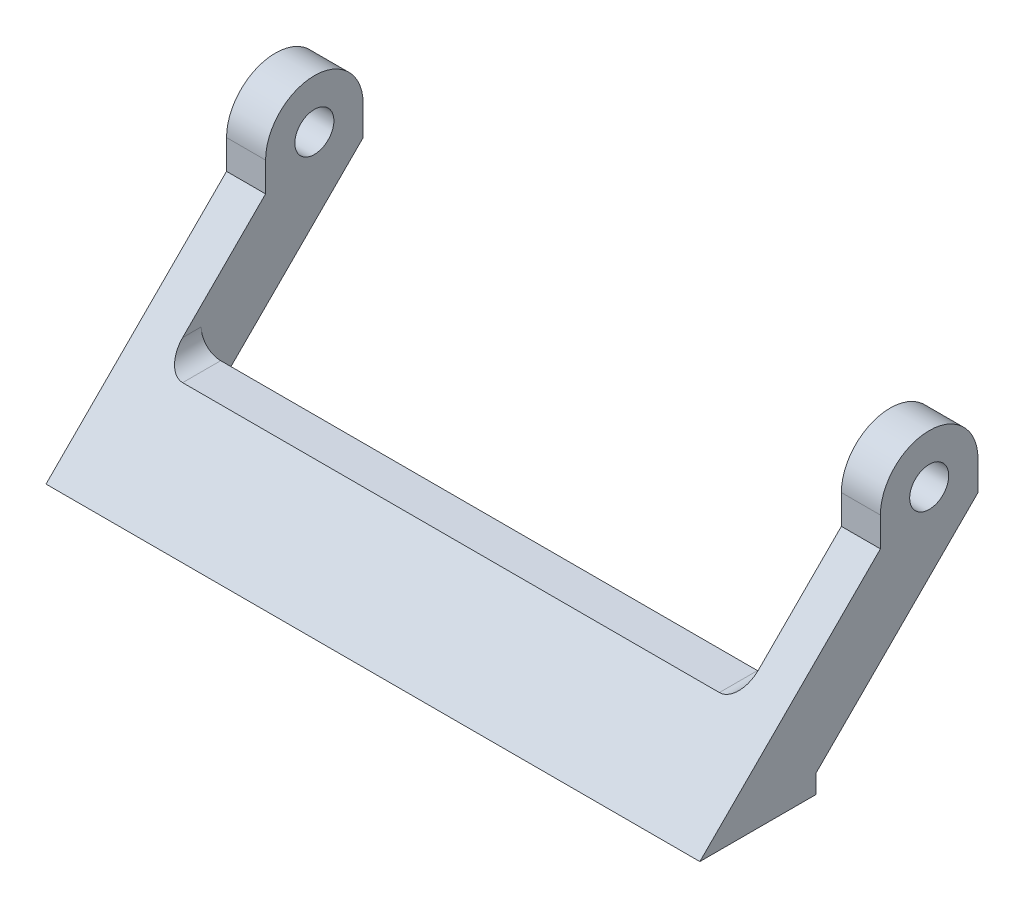
ISO-10303-21;
HEADER;
FILE_DESCRIPTION(('STEP AP214'),'2;1');
FILE_NAME('part.step','',(''),(''),'','','');
FILE_SCHEMA(('AUTOMOTIVE_DESIGN { 1 0 10303 214 1 1 1 1 }'));
ENDSEC;
DATA;
#1=APPLICATION_CONTEXT('core data for automotive mechanical design processes');
#2=APPLICATION_PROTOCOL_DEFINITION('international standard','automotive_design',2000,#1);
#3=PRODUCT_CONTEXT('',#1,'mechanical');
#4=PRODUCT('Part','Part','',(#3));
#5=PRODUCT_RELATED_PRODUCT_CATEGORY('part','',(#4));
#6=PRODUCT_DEFINITION_FORMATION('','',#4);
#7=PRODUCT_DEFINITION_CONTEXT('part definition',#1,'design');
#8=PRODUCT_DEFINITION('design','',#6,#7);
#9=PRODUCT_DEFINITION_SHAPE('','',#8);
#10=(LENGTH_UNIT() NAMED_UNIT(*) SI_UNIT(.MILLI.,.METRE.));
#11=(NAMED_UNIT(*) PLANE_ANGLE_UNIT() SI_UNIT($,.RADIAN.));
#12=(NAMED_UNIT(*) SI_UNIT($,.STERADIAN.) SOLID_ANGLE_UNIT());
#13=UNCERTAINTY_MEASURE_WITH_UNIT(LENGTH_MEASURE(1.E-05),#10,'distance_accuracy_value','');
#14=(GEOMETRIC_REPRESENTATION_CONTEXT(3) GLOBAL_UNCERTAINTY_ASSIGNED_CONTEXT((#13)) GLOBAL_UNIT_ASSIGNED_CONTEXT((#10,
#11,#12)) REPRESENTATION_CONTEXT('',''));
#15=CARTESIAN_POINT('',(0.,0.,0.));
#16=DIRECTION('',(0.,0.,1.));
#17=DIRECTION('',(1.,0.,0.));
#18=AXIS2_PLACEMENT_3D('',#15,#16,#17);
#19=CARTESIAN_POINT('',(29.5,11.6066017177982,-32.8033008588992));
#20=DIRECTION('',(1.,0.,0.));
#21=DIRECTION('',(0.,1.,0.));
#22=AXIS2_PLACEMENT_3D('',#19,#20,#21);
#23=PLANE('',#22);
#24=CARTESIAN_POINT('',(29.5,0.,0.));
#25=DIRECTION('',(1.,0.,0.));
#26=DIRECTION('',(0.,1.,0.));
#27=AXIS2_PLACEMENT_3D('',#24,#25,#26);
#28=CIRCLE('',#27,2.);
#29=CARTESIAN_POINT('',(29.5,2.,0.));
#30=VERTEX_POINT('',#29);
#31=EDGE_CURVE('E192',#30,#30,#28,.T.);
#32=ORIENTED_EDGE('',*,*,#31,.T.);
#33=EDGE_LOOP('',(#32));
#34=FACE_BOUND('',#33,.T.);
#35=DIRECTION('',(0.,1.,0.));
#36=VECTOR('',#35,1.);
#37=CARTESIAN_POINT('',(29.5,-21.5,11.6000000000001));
#38=LINE('',#37,#36);
#39=CARTESIAN_POINT('',(29.5,-19.6,11.6000000000001));
#40=VERTEX_POINT('',#39);
#41=CARTESIAN_POINT('',(29.5,-11.5,11.6000000000001));
#42=VERTEX_POINT('',#41);
#43=EDGE_CURVE('E147',#40,#42,#38,.T.);
#44=ORIENTED_EDGE('',*,*,#43,.T.);
#45=DIRECTION('',(0.,0.,-1.));
#46=VECTOR('',#45,1.);
#47=CARTESIAN_POINT('',(29.5,-11.5,-32.8033008588992));
#48=LINE('',#47,#46);
#49=CARTESIAN_POINT('',(29.5,-11.5,13.5));
#50=VERTEX_POINT('',#49);
#51=EDGE_CURVE('E204',#42,#50,#48,.F.);
#52=ORIENTED_EDGE('',*,*,#51,.T.);
#53=DIRECTION('',(0.,-0.707106781186546,0.707106781186549));
#54=VECTOR('',#53,1.);
#55=CARTESIAN_POINT('',(29.5,-3.,5.));
#56=LINE('',#55,#54);
#57=CARTESIAN_POINT('',(29.5,-3.,5.));
#58=VERTEX_POINT('',#57);
#59=EDGE_CURVE('E198',#58,#50,#56,.T.);
#60=ORIENTED_EDGE('',*,*,#59,.F.);
#61=DIRECTION('',(0.,-1.,0.));
#62=VECTOR('',#61,1.);
#63=CARTESIAN_POINT('',(29.5,0.,5.));
#64=LINE('',#63,#62);
#65=CARTESIAN_POINT('',(29.5,0.,5.));
#66=VERTEX_POINT('',#65);
#67=EDGE_CURVE('E229',#66,#58,#64,.T.);
#68=ORIENTED_EDGE('',*,*,#67,.F.);
#69=CARTESIAN_POINT('',(29.5,0.,0.));
#70=DIRECTION('',(1.,0.,0.));
#71=DIRECTION('',(0.,1.,0.));
#72=AXIS2_PLACEMENT_3D('',#69,#70,#71);
#73=CIRCLE('',#72,5.);
#74=CARTESIAN_POINT('',(29.5,0.,-5.));
#75=VERTEX_POINT('',#74);
#76=EDGE_CURVE('E155',#75,#66,#73,.T.);
#77=ORIENTED_EDGE('',*,*,#76,.F.);
#78=DIRECTION('',(0.,1.,0.));
#79=VECTOR('',#78,1.);
#80=CARTESIAN_POINT('',(29.5,0.,-5.));
#81=LINE('',#80,#79);
#82=CARTESIAN_POINT('',(29.5,-3.,-5.));
#83=VERTEX_POINT('',#82);
#84=EDGE_CURVE('E150',#83,#75,#81,.T.);
#85=ORIENTED_EDGE('',*,*,#84,.F.);
#86=DIRECTION('',(0.,0.707106781186546,-0.707106781186549));
#87=VECTOR('',#86,1.);
#88=CARTESIAN_POINT('',(29.5,-3.,-5.));
#89=LINE('',#88,#87);
#90=EDGE_CURVE('E145',#40,#83,#89,.T.);
#91=ORIENTED_EDGE('',*,*,#90,.F.);
#92=EDGE_LOOP('',(#44,#52,#60,#68,#77,#85,#91));
#93=FACE_BOUND('',#92,.T.);
#94=ADVANCED_FACE('F34',(#34,#93),#23,.F.);
#95=CARTESIAN_POINT('',(-29.5,4.53553390593272,-25.7322330470337));
#96=DIRECTION('',(-1.,0.,0.));
#97=DIRECTION('',(0.,-1.,0.));
#98=AXIS2_PLACEMENT_3D('',#95,#96,#97);
#99=PLANE('',#98);
#100=CARTESIAN_POINT('',(-29.5,0.,0.));
#101=DIRECTION('',(-1.,0.,0.));
#102=DIRECTION('',(0.,-1.,0.));
#103=AXIS2_PLACEMENT_3D('',#100,#101,#102);
#104=CIRCLE('',#103,2.);
#105=CARTESIAN_POINT('',(-29.5,-2.,0.));
#106=VERTEX_POINT('',#105);
#107=EDGE_CURVE('E165',#106,#106,#104,.T.);
#108=ORIENTED_EDGE('',*,*,#107,.T.);
#109=EDGE_LOOP('',(#108));
#110=FACE_BOUND('',#109,.T.);
#111=DIRECTION('',(0.,0.707106781186546,-0.707106781186549));
#112=VECTOR('',#111,1.);
#113=CARTESIAN_POINT('',(-29.5,-3.00000000000001,5.00000000000001));
#114=LINE('',#113,#112);
#115=CARTESIAN_POINT('',(-29.5,-11.5,13.5));
#116=VERTEX_POINT('',#115);
#117=CARTESIAN_POINT('',(-29.5,-3.,5.));
#118=VERTEX_POINT('',#117);
#119=EDGE_CURVE('E195',#116,#118,#114,.T.);
#120=ORIENTED_EDGE('',*,*,#119,.F.);
#121=DIRECTION('',(0.,0.,1.));
#122=VECTOR('',#121,1.);
#123=CARTESIAN_POINT('',(-29.5,-11.5,-25.7322330470337));
#124=LINE('',#123,#122);
#125=CARTESIAN_POINT('',(-29.5,-11.5,11.6000000000001));
#126=VERTEX_POINT('',#125);
#127=EDGE_CURVE('E206',#116,#126,#124,.F.);
#128=ORIENTED_EDGE('',*,*,#127,.T.);
#129=DIRECTION('',(0.,1.,0.));
#130=VECTOR('',#129,1.);
#131=CARTESIAN_POINT('',(-29.5,-21.5,11.6000000000001));
#132=LINE('',#131,#130);
#133=CARTESIAN_POINT('',(-29.5,-19.6,11.6000000000001));
#134=VERTEX_POINT('',#133);
#135=EDGE_CURVE('E48',#134,#126,#132,.T.);
#136=ORIENTED_EDGE('',*,*,#135,.F.);
#137=DIRECTION('',(0.,-0.707106781186546,0.707106781186549));
#138=VECTOR('',#137,1.);
#139=CARTESIAN_POINT('',(-29.5,-3.00000000000001,-4.99999999999999));
#140=LINE('',#139,#138);
#141=CARTESIAN_POINT('',(-29.5,-3.,-5.));
#142=VERTEX_POINT('',#141);
#143=EDGE_CURVE('E308',#142,#134,#140,.T.);
#144=ORIENTED_EDGE('',*,*,#143,.F.);
#145=DIRECTION('',(0.,-1.,0.));
#146=VECTOR('',#145,1.);
#147=CARTESIAN_POINT('',(-29.5,0.,-5.));
#148=LINE('',#147,#146);
#149=CARTESIAN_POINT('',(-29.5,0.,-5.));
#150=VERTEX_POINT('',#149);
#151=EDGE_CURVE('E191',#150,#142,#148,.T.);
#152=ORIENTED_EDGE('',*,*,#151,.F.);
#153=CARTESIAN_POINT('',(-29.5,0.,0.));
#154=DIRECTION('',(-1.,0.,0.));
#155=DIRECTION('',(0.,-1.,0.));
#156=AXIS2_PLACEMENT_3D('',#153,#154,#155);
#157=CIRCLE('',#156,5.);
#158=CARTESIAN_POINT('',(-29.5,0.,5.));
#159=VERTEX_POINT('',#158);
#160=EDGE_CURVE('E288',#159,#150,#157,.T.);
#161=ORIENTED_EDGE('',*,*,#160,.F.);
#162=DIRECTION('',(0.,1.,0.));
#163=VECTOR('',#162,1.);
#164=CARTESIAN_POINT('',(-29.5,0.,5.));
#165=LINE('',#164,#163);
#166=EDGE_CURVE('E203',#118,#159,#165,.T.);
#167=ORIENTED_EDGE('',*,*,#166,.F.);
#168=EDGE_LOOP('',(#120,#128,#136,#144,#152,#161,#167));
#169=FACE_BOUND('',#168,.T.);
#170=ADVANCED_FACE('F340',(#110,#169),#99,.F.);
#171=CARTESIAN_POINT('',(33.5,-3.,5.));
#172=DIRECTION('',(0.,-0.707106781186549,-0.707106781186546));
#173=DIRECTION('',(0.,0.707106781186546,-0.707106781186549));
#174=AXIS2_PLACEMENT_3D('',#171,#172,#173);
#175=PLANE('',#174);
#176=ORIENTED_EDGE('',*,*,#59,.T.);
#177=CARTESIAN_POINT('',(27.5,-11.5,13.5));
#178=DIRECTION('',(0.,-0.707106781186549,-0.707106781186546));
#179=DIRECTION('',(0.,0.707106781186546,-0.707106781186549));
#180=AXIS2_PLACEMENT_3D('',#177,#178,#179);
#181=ELLIPSE('',#180,2.82842712474619,2.);
#182=CARTESIAN_POINT('',(27.5,-13.5,15.5));
#183=VERTEX_POINT('',#182);
#184=EDGE_CURVE('E209',#50,#183,#181,.T.);
#185=ORIENTED_EDGE('',*,*,#184,.T.);
#186=DIRECTION('',(-1.,0.,0.));
#187=VECTOR('',#186,1.);
#188=CARTESIAN_POINT('',(0.,-13.5,15.5));
#189=LINE('',#188,#187);
#190=CARTESIAN_POINT('',(-27.5,-13.5,15.5));
#191=VERTEX_POINT('',#190);
#192=EDGE_CURVE('E188',#183,#191,#189,.T.);
#193=ORIENTED_EDGE('',*,*,#192,.T.);
#194=CARTESIAN_POINT('',(-27.5,-11.5,13.5));
#195=DIRECTION('',(0.,-0.707106781186549,-0.707106781186546));
#196=DIRECTION('',(0.,-0.707106781186546,0.707106781186549));
#197=AXIS2_PLACEMENT_3D('',#194,#195,#196);
#198=ELLIPSE('',#197,2.82842712474619,2.);
#199=EDGE_CURVE('E42',#191,#116,#198,.T.);
#200=ORIENTED_EDGE('',*,*,#199,.T.);
#201=ORIENTED_EDGE('',*,*,#119,.T.);
#202=DIRECTION('',(-1.,0.,0.));
#203=VECTOR('',#202,1.);
#204=CARTESIAN_POINT('',(33.5,-3.,5.));
#205=LINE('',#204,#203);
#206=CARTESIAN_POINT('',(-33.5,-3.,5.));
#207=VERTEX_POINT('',#206);
#208=EDGE_CURVE('E180',#118,#207,#205,.T.);
#209=ORIENTED_EDGE('',*,*,#208,.T.);
#210=DIRECTION('',(0.,-0.707106781186546,0.707106781186549));
#211=VECTOR('',#210,1.);
#212=CARTESIAN_POINT('',(-33.5,-3.,5.));
#213=LINE('',#212,#211);
#214=CARTESIAN_POINT('',(-33.5,-21.5,23.5000000000001));
#215=VERTEX_POINT('',#214);
#216=EDGE_CURVE('E263',#207,#215,#213,.T.);
#217=ORIENTED_EDGE('',*,*,#216,.T.);
#218=DIRECTION('',(-1.,0.,0.));
#219=VECTOR('',#218,1.);
#220=CARTESIAN_POINT('',(33.5,-21.5,23.5000000000001));
#221=LINE('',#220,#219);
#222=CARTESIAN_POINT('',(33.5,-21.5,23.5000000000001));
#223=VERTEX_POINT('',#222);
#224=EDGE_CURVE('E172',#223,#215,#221,.T.);
#225=ORIENTED_EDGE('',*,*,#224,.F.);
#226=DIRECTION('',(0.,-0.707106781186546,0.707106781186549));
#227=VECTOR('',#226,1.);
#228=CARTESIAN_POINT('',(33.5,-3.,5.));
#229=LINE('',#228,#227);
#230=CARTESIAN_POINT('',(33.5,-3.,5.));
#231=VERTEX_POINT('',#230);
#232=EDGE_CURVE('E239',#231,#223,#229,.T.);
#233=ORIENTED_EDGE('',*,*,#232,.F.);
#234=EDGE_CURVE('E181',#231,#58,#205,.T.);
#235=ORIENTED_EDGE('',*,*,#234,.T.);
#236=EDGE_LOOP('',(#176,#185,#193,#200,#201,#209,#217,#225,#233,#235));
#237=FACE_BOUND('',#236,.T.);
#238=ADVANCED_FACE('F213',(#237),#175,.F.);
#239=CARTESIAN_POINT('',(33.5,-19.6,11.6000000000001));
#240=DIRECTION('',(0.,0.,1.));
#241=DIRECTION('',(1.,0.,0.));
#242=AXIS2_PLACEMENT_3D('',#239,#240,#241);
#243=PLANE('',#242);
#244=ORIENTED_EDGE('',*,*,#135,.T.);
#245=CARTESIAN_POINT('',(-27.5,-11.5,11.6000000000001));
#246=DIRECTION('',(0.,0.,1.));
#247=DIRECTION('',(1.,0.,0.));
#248=AXIS2_PLACEMENT_3D('',#245,#246,#247);
#249=CIRCLE('',#248,2.);
#250=CARTESIAN_POINT('',(-27.5,-13.5,11.6000000000001));
#251=VERTEX_POINT('',#250);
#252=EDGE_CURVE('E11',#126,#251,#249,.T.);
#253=ORIENTED_EDGE('',*,*,#252,.T.);
#254=DIRECTION('',(-1.,0.,0.));
#255=VECTOR('',#254,1.);
#256=CARTESIAN_POINT('',(29.5,-13.5,11.6000000000001));
#257=LINE('',#256,#255);
#258=CARTESIAN_POINT('',(27.5,-13.5,11.6000000000001));
#259=VERTEX_POINT('',#258);
#260=EDGE_CURVE('E379',#259,#251,#257,.T.);
#261=ORIENTED_EDGE('',*,*,#260,.F.);
#262=CARTESIAN_POINT('',(27.5,-11.5,11.6000000000001));
#263=DIRECTION('',(0.,0.,1.));
#264=DIRECTION('',(1.,0.,0.));
#265=AXIS2_PLACEMENT_3D('',#262,#263,#264);
#266=CIRCLE('',#265,2.);
#267=EDGE_CURVE('E163',#259,#42,#266,.T.);
#268=ORIENTED_EDGE('',*,*,#267,.T.);
#269=ORIENTED_EDGE('',*,*,#43,.F.);
#270=DIRECTION('',(-1.,0.,0.));
#271=VECTOR('',#270,1.);
#272=CARTESIAN_POINT('',(33.5,-19.6,11.6000000000001));
#273=LINE('',#272,#271);
#274=CARTESIAN_POINT('',(33.5,-19.6,11.6000000000001));
#275=VERTEX_POINT('',#274);
#276=EDGE_CURVE('E160',#275,#40,#273,.T.);
#277=ORIENTED_EDGE('',*,*,#276,.F.);
#278=DIRECTION('',(0.,1.,0.));
#279=VECTOR('',#278,1.);
#280=CARTESIAN_POINT('',(33.5,-19.6,11.6000000000001));
#281=LINE('',#280,#279);
#282=CARTESIAN_POINT('',(33.5,-21.5,11.6000000000001));
#283=VERTEX_POINT('',#282);
#284=EDGE_CURVE('E245',#283,#275,#281,.T.);
#285=ORIENTED_EDGE('',*,*,#284,.F.);
#286=DIRECTION('',(-1.,0.,0.));
#287=VECTOR('',#286,1.);
#288=CARTESIAN_POINT('',(33.5,-21.5,11.6000000000001));
#289=LINE('',#288,#287);
#290=CARTESIAN_POINT('',(-33.5,-21.5,11.6000000000001));
#291=VERTEX_POINT('',#290);
#292=EDGE_CURVE('E169',#283,#291,#289,.T.);
#293=ORIENTED_EDGE('',*,*,#292,.T.);
#294=DIRECTION('',(0.,1.,0.));
#295=VECTOR('',#294,1.);
#296=CARTESIAN_POINT('',(-33.5,-19.6,11.6000000000001));
#297=LINE('',#296,#295);
#298=CARTESIAN_POINT('',(-33.5,-19.6,11.6000000000001));
#299=VERTEX_POINT('',#298);
#300=EDGE_CURVE('E268',#291,#299,#297,.T.);
#301=ORIENTED_EDGE('',*,*,#300,.T.);
#302=EDGE_CURVE('E170',#134,#299,#273,.T.);
#303=ORIENTED_EDGE('',*,*,#302,.F.);
#304=EDGE_LOOP('',(#244,#253,#261,#268,#269,#277,#285,#293,#301,#303));
#305=FACE_BOUND('',#304,.T.);
#306=ADVANCED_FACE('F158',(#305),#243,.F.);
#307=CARTESIAN_POINT('',(33.5,-3.,-5.));
#308=DIRECTION('',(0.,0.707106781186549,0.707106781186546));
#309=DIRECTION('',(0.,-0.707106781186546,0.707106781186549));
#310=AXIS2_PLACEMENT_3D('',#307,#308,#309);
#311=PLANE('',#310);
#312=ORIENTED_EDGE('',*,*,#276,.T.);
#313=ORIENTED_EDGE('',*,*,#90,.T.);
#314=DIRECTION('',(-1.,0.,0.));
#315=VECTOR('',#314,1.);
#316=CARTESIAN_POINT('',(33.5,-3.,-5.));
#317=LINE('',#316,#315);
#318=CARTESIAN_POINT('',(33.5,-3.,-5.));
#319=VERTEX_POINT('',#318);
#320=EDGE_CURVE('E174',#319,#83,#317,.T.);
#321=ORIENTED_EDGE('',*,*,#320,.F.);
#322=DIRECTION('',(0.,0.707106781186546,-0.707106781186549));
#323=VECTOR('',#322,1.);
#324=CARTESIAN_POINT('',(33.5,-3.,-5.));
#325=LINE('',#324,#323);
#326=EDGE_CURVE('E168',#275,#319,#325,.T.);
#327=ORIENTED_EDGE('',*,*,#326,.F.);
#328=EDGE_LOOP('',(#312,#313,#321,#327));
#329=FACE_BOUND('',#328,.T.);
#330=ADVANCED_FACE('F167',(#329),#311,.F.);
#331=CARTESIAN_POINT('',(33.5,0.,0.));
#332=DIRECTION('',(-1.,0.,0.));
#333=DIRECTION('',(0.,0.,1.));
#334=AXIS2_PLACEMENT_3D('',#331,#332,#333);
#335=CYLINDRICAL_SURFACE('',#334,5.);
#336=DIRECTION('',(-1.,0.,0.));
#337=VECTOR('',#336,1.);
#338=CARTESIAN_POINT('',(33.5,0.,-5.));
#339=LINE('',#338,#337);
#340=CARTESIAN_POINT('',(33.5,0.,-5.));
#341=VERTEX_POINT('',#340);
#342=EDGE_CURVE('E276',#341,#75,#339,.T.);
#343=ORIENTED_EDGE('',*,*,#342,.T.);
#344=ORIENTED_EDGE('',*,*,#76,.T.);
#345=DIRECTION('',(-1.,0.,0.));
#346=VECTOR('',#345,1.);
#347=CARTESIAN_POINT('',(33.5,0.,5.));
#348=LINE('',#347,#346);
#349=CARTESIAN_POINT('',(33.5,0.,5.));
#350=VERTEX_POINT('',#349);
#351=EDGE_CURVE('E185',#350,#66,#348,.T.);
#352=ORIENTED_EDGE('',*,*,#351,.F.);
#353=CARTESIAN_POINT('',(33.5,0.,0.));
#354=DIRECTION('',(1.,0.,0.));
#355=DIRECTION('',(0.,0.,1.));
#356=AXIS2_PLACEMENT_3D('',#353,#354,#355);
#357=CIRCLE('',#356,5.);
#358=EDGE_CURVE('E247',#341,#350,#357,.T.);
#359=ORIENTED_EDGE('',*,*,#358,.F.);
#360=EDGE_LOOP('',(#343,#344,#352,#359));
#361=FACE_BOUND('',#360,.T.);
#362=ADVANCED_FACE('F321',(#361),#335,.T.);
#363=CARTESIAN_POINT('',(33.5,0.,5.));
#364=DIRECTION('',(0.,0.,-1.));
#365=DIRECTION('',(0.,1.,0.));
#366=AXIS2_PLACEMENT_3D('',#363,#364,#365);
#367=PLANE('',#366);
#368=ORIENTED_EDGE('',*,*,#351,.T.);
#369=ORIENTED_EDGE('',*,*,#67,.T.);
#370=ORIENTED_EDGE('',*,*,#234,.F.);
#371=DIRECTION('',(0.,-1.,0.));
#372=VECTOR('',#371,1.);
#373=CARTESIAN_POINT('',(33.5,0.,5.));
#374=LINE('',#373,#372);
#375=EDGE_CURVE('E243',#350,#231,#374,.T.);
#376=ORIENTED_EDGE('',*,*,#375,.F.);
#377=EDGE_LOOP('',(#368,#369,#370,#376));
#378=FACE_BOUND('',#377,.T.);
#379=ADVANCED_FACE('F234',(#378),#367,.F.);
#380=CARTESIAN_POINT('',(33.5,0.,-5.));
#381=DIRECTION('',(0.,0.,1.));
#382=DIRECTION('',(0.,-1.,0.));
#383=AXIS2_PLACEMENT_3D('',#380,#381,#382);
#384=PLANE('',#383);
#385=ORIENTED_EDGE('',*,*,#320,.T.);
#386=ORIENTED_EDGE('',*,*,#84,.T.);
#387=ORIENTED_EDGE('',*,*,#342,.F.);
#388=DIRECTION('',(0.,1.,0.));
#389=VECTOR('',#388,1.);
#390=CARTESIAN_POINT('',(33.5,0.,-5.));
#391=LINE('',#390,#389);
#392=EDGE_CURVE('E253',#319,#341,#391,.T.);
#393=ORIENTED_EDGE('',*,*,#392,.F.);
#394=EDGE_LOOP('',(#385,#386,#387,#393));
#395=FACE_BOUND('',#394,.T.);
#396=ADVANCED_FACE('F323',(#395),#384,.F.);
#397=CARTESIAN_POINT('',(33.5,0.,0.));
#398=DIRECTION('',(-1.,0.,0.));
#399=DIRECTION('',(0.,0.,1.));
#400=AXIS2_PLACEMENT_3D('',#397,#398,#399);
#401=CYLINDRICAL_SURFACE('',#400,2.);
#402=ORIENTED_EDGE('',*,*,#31,.F.);
#403=EDGE_LOOP('',(#402));
#404=FACE_BOUND('',#403,.T.);
#405=CARTESIAN_POINT('',(33.5,0.,0.));
#406=DIRECTION('',(1.,0.,0.));
#407=DIRECTION('',(0.,0.,-1.));
#408=AXIS2_PLACEMENT_3D('',#405,#406,#407);
#409=CIRCLE('',#408,2.);
#410=CARTESIAN_POINT('',(33.5,0.,-2.));
#411=VERTEX_POINT('',#410);
#412=EDGE_CURVE('E260',#411,#411,#409,.T.);
#413=ORIENTED_EDGE('',*,*,#412,.T.);
#414=EDGE_LOOP('',(#413));
#415=FACE_BOUND('',#414,.T.);
#416=ADVANCED_FACE('F325',(#404,#415),#401,.F.);
#417=CARTESIAN_POINT('',(33.5,0.,0.));
#418=DIRECTION('',(-1.,0.,0.));
#419=DIRECTION('',(0.,0.,1.));
#420=AXIS2_PLACEMENT_3D('',#417,#418,#419);
#421=PLANE('',#420);
#422=ORIENTED_EDGE('',*,*,#358,.T.);
#423=ORIENTED_EDGE('',*,*,#375,.T.);
#424=ORIENTED_EDGE('',*,*,#232,.T.);
#425=DIRECTION('',(0.,0.,-1.));
#426=VECTOR('',#425,1.);
#427=CARTESIAN_POINT('',(33.5,-21.5,23.5000000000001));
#428=LINE('',#427,#426);
#429=EDGE_CURVE('E242',#223,#283,#428,.T.);
#430=ORIENTED_EDGE('',*,*,#429,.T.);
#431=ORIENTED_EDGE('',*,*,#284,.T.);
#432=ORIENTED_EDGE('',*,*,#326,.T.);
#433=ORIENTED_EDGE('',*,*,#392,.T.);
#434=EDGE_LOOP('',(#422,#423,#424,#430,#431,#432,#433));
#435=FACE_BOUND('',#434,.T.);
#436=ORIENTED_EDGE('',*,*,#412,.F.);
#437=EDGE_LOOP('',(#436));
#438=FACE_BOUND('',#437,.T.);
#439=ADVANCED_FACE('F318',(#435,#438),#421,.F.);
#440=CARTESIAN_POINT('',(-33.5,0.,0.));
#441=DIRECTION('',(-1.,0.,0.));
#442=DIRECTION('',(0.,0.,1.));
#443=AXIS2_PLACEMENT_3D('',#440,#441,#442);
#444=PLANE('',#443);
#445=CARTESIAN_POINT('',(-33.5,0.,0.));
#446=DIRECTION('',(1.,0.,0.));
#447=DIRECTION('',(0.,0.,1.));
#448=AXIS2_PLACEMENT_3D('',#445,#446,#447);
#449=CIRCLE('',#448,5.);
#450=CARTESIAN_POINT('',(-33.5,0.,-5.));
#451=VERTEX_POINT('',#450);
#452=CARTESIAN_POINT('',(-33.5,0.,5.));
#453=VERTEX_POINT('',#452);
#454=EDGE_CURVE('E256',#451,#453,#449,.T.);
#455=ORIENTED_EDGE('',*,*,#454,.F.);
#456=DIRECTION('',(0.,1.,0.));
#457=VECTOR('',#456,1.);
#458=CARTESIAN_POINT('',(-33.5,0.,-5.));
#459=LINE('',#458,#457);
#460=CARTESIAN_POINT('',(-33.5,-3.,-5.));
#461=VERTEX_POINT('',#460);
#462=EDGE_CURVE('E274',#461,#451,#459,.T.);
#463=ORIENTED_EDGE('',*,*,#462,.F.);
#464=DIRECTION('',(0.,0.707106781186546,-0.707106781186549));
#465=VECTOR('',#464,1.);
#466=CARTESIAN_POINT('',(-33.5,-3.,-5.));
#467=LINE('',#466,#465);
#468=EDGE_CURVE('E271',#299,#461,#467,.T.);
#469=ORIENTED_EDGE('',*,*,#468,.F.);
#470=ORIENTED_EDGE('',*,*,#300,.F.);
#471=DIRECTION('',(0.,0.,-1.));
#472=VECTOR('',#471,1.);
#473=CARTESIAN_POINT('',(-33.5,-21.5,23.5000000000001));
#474=LINE('',#473,#472);
#475=EDGE_CURVE('E265',#215,#291,#474,.T.);
#476=ORIENTED_EDGE('',*,*,#475,.F.);
#477=ORIENTED_EDGE('',*,*,#216,.F.);
#478=DIRECTION('',(0.,-1.,0.));
#479=VECTOR('',#478,1.);
#480=CARTESIAN_POINT('',(-33.5,0.,5.));
#481=LINE('',#480,#479);
#482=EDGE_CURVE('E259',#453,#207,#481,.T.);
#483=ORIENTED_EDGE('',*,*,#482,.F.);
#484=EDGE_LOOP('',(#455,#463,#469,#470,#476,#477,#483));
#485=FACE_BOUND('',#484,.T.);
#486=CARTESIAN_POINT('',(-33.5,0.,0.));
#487=DIRECTION('',(1.,0.,0.));
#488=DIRECTION('',(0.,0.,-1.));
#489=AXIS2_PLACEMENT_3D('',#486,#487,#488);
#490=CIRCLE('',#489,2.);
#491=CARTESIAN_POINT('',(-33.5,0.,-2.));
#492=VERTEX_POINT('',#491);
#493=EDGE_CURVE('E231',#492,#492,#490,.T.);
#494=ORIENTED_EDGE('',*,*,#493,.T.);
#495=EDGE_LOOP('',(#494));
#496=FACE_BOUND('',#495,.T.);
#497=ADVANCED_FACE('F297',(#485,#496),#444,.T.);
#498=EDGE_CURVE('E184',#159,#453,#348,.T.);
#499=ORIENTED_EDGE('',*,*,#498,.F.);
#500=ORIENTED_EDGE('',*,*,#160,.T.);
#501=EDGE_CURVE('E255',#150,#451,#339,.T.);
#502=ORIENTED_EDGE('',*,*,#501,.T.);
#503=ORIENTED_EDGE('',*,*,#454,.T.);
#504=EDGE_LOOP('',(#499,#500,#502,#503));
#505=FACE_BOUND('',#504,.T.);
#506=ADVANCED_FACE('F286',(#505),#335,.T.);
#507=ORIENTED_EDGE('',*,*,#208,.F.);
#508=ORIENTED_EDGE('',*,*,#166,.T.);
#509=ORIENTED_EDGE('',*,*,#498,.T.);
#510=ORIENTED_EDGE('',*,*,#482,.T.);
#511=EDGE_LOOP('',(#507,#508,#509,#510));
#512=FACE_BOUND('',#511,.T.);
#513=ADVANCED_FACE('F303',(#512),#367,.F.);
#514=CARTESIAN_POINT('',(33.5,-21.5,23.5000000000001));
#515=DIRECTION('',(0.,1.,0.));
#516=DIRECTION('',(0.,0.,1.));
#517=AXIS2_PLACEMENT_3D('',#514,#515,#516);
#518=PLANE('',#517);
#519=ORIENTED_EDGE('',*,*,#475,.T.);
#520=ORIENTED_EDGE('',*,*,#292,.F.);
#521=ORIENTED_EDGE('',*,*,#429,.F.);
#522=ORIENTED_EDGE('',*,*,#224,.T.);
#523=EDGE_LOOP('',(#519,#520,#521,#522));
#524=FACE_BOUND('',#523,.T.);
#525=ADVANCED_FACE('F361',(#524),#518,.F.);
#526=ORIENTED_EDGE('',*,*,#143,.T.);
#527=ORIENTED_EDGE('',*,*,#302,.T.);
#528=ORIENTED_EDGE('',*,*,#468,.T.);
#529=EDGE_CURVE('E278',#142,#461,#317,.T.);
#530=ORIENTED_EDGE('',*,*,#529,.F.);
#531=EDGE_LOOP('',(#526,#527,#528,#530));
#532=FACE_BOUND('',#531,.T.);
#533=ADVANCED_FACE('F338',(#532),#311,.F.);
#534=ORIENTED_EDGE('',*,*,#501,.F.);
#535=ORIENTED_EDGE('',*,*,#151,.T.);
#536=ORIENTED_EDGE('',*,*,#529,.T.);
#537=ORIENTED_EDGE('',*,*,#462,.T.);
#538=EDGE_LOOP('',(#534,#535,#536,#537));
#539=FACE_BOUND('',#538,.T.);
#540=ADVANCED_FACE('F292',(#539),#384,.F.);
#541=ORIENTED_EDGE('',*,*,#107,.F.);
#542=EDGE_LOOP('',(#541));
#543=FACE_BOUND('',#542,.T.);
#544=ORIENTED_EDGE('',*,*,#493,.F.);
#545=EDGE_LOOP('',(#544));
#546=FACE_BOUND('',#545,.T.);
#547=ADVANCED_FACE('F333',(#543,#546),#401,.F.);
#548=CARTESIAN_POINT('',(0.,-13.5,0.));
#549=DIRECTION('',(0.,1.,0.));
#550=DIRECTION('',(0.,0.,1.));
#551=AXIS2_PLACEMENT_3D('',#548,#549,#550);
#552=PLANE('',#551);
#553=ORIENTED_EDGE('',*,*,#192,.F.);
#554=DIRECTION('',(0.,0.,-1.));
#555=VECTOR('',#554,1.);
#556=CARTESIAN_POINT('',(27.5,-13.5,0.));
#557=LINE('',#556,#555);
#558=EDGE_CURVE('E221',#183,#259,#557,.T.);
#559=ORIENTED_EDGE('',*,*,#558,.T.);
#560=ORIENTED_EDGE('',*,*,#260,.T.);
#561=DIRECTION('',(0.,0.,1.));
#562=VECTOR('',#561,1.);
#563=CARTESIAN_POINT('',(-27.5,-13.5,0.));
#564=LINE('',#563,#562);
#565=EDGE_CURVE('E223',#251,#191,#564,.T.);
#566=ORIENTED_EDGE('',*,*,#565,.T.);
#567=EDGE_LOOP('',(#553,#559,#560,#566));
#568=FACE_BOUND('',#567,.T.);
#569=ADVANCED_FACE('F219',(#568),#552,.T.);
#570=CARTESIAN_POINT('',(27.5,-11.5,0.));
#571=DIRECTION('',(0.,0.,-1.));
#572=DIRECTION('',(-1.,0.,0.));
#573=AXIS2_PLACEMENT_3D('',#570,#571,#572);
#574=CYLINDRICAL_SURFACE('',#573,2.);
#575=ORIENTED_EDGE('',*,*,#184,.F.);
#576=ORIENTED_EDGE('',*,*,#51,.F.);
#577=ORIENTED_EDGE('',*,*,#267,.F.);
#578=ORIENTED_EDGE('',*,*,#558,.F.);
#579=EDGE_LOOP('',(#575,#576,#577,#578));
#580=FACE_BOUND('',#579,.T.);
#581=ADVANCED_FACE('F225',(#580),#574,.F.);
#582=CARTESIAN_POINT('',(-27.5,-11.5,0.));
#583=DIRECTION('',(0.,0.,1.));
#584=DIRECTION('',(1.,0.,0.));
#585=AXIS2_PLACEMENT_3D('',#582,#583,#584);
#586=CYLINDRICAL_SURFACE('',#585,2.);
#587=ORIENTED_EDGE('',*,*,#252,.F.);
#588=ORIENTED_EDGE('',*,*,#127,.F.);
#589=ORIENTED_EDGE('',*,*,#199,.F.);
#590=ORIENTED_EDGE('',*,*,#565,.F.);
#591=EDGE_LOOP('',(#587,#588,#589,#590));
#592=FACE_BOUND('',#591,.T.);
#593=ADVANCED_FACE('F36',(#592),#586,.F.);
#594=CLOSED_SHELL('',(#94,#170,#238,#306,#330,#362,#379,#396,#416,#439,#497,#506,#513,#525,#533,
#540,#547,#569,#581,#593));
#595=MANIFOLD_SOLID_BREP('B2',#594);
#596=ADVANCED_BREP_SHAPE_REPRESENTATION('',(#18,#595),#14);
#597=SHAPE_DEFINITION_REPRESENTATION(#9,#596);
ENDSEC;
END-ISO-10303-21;
